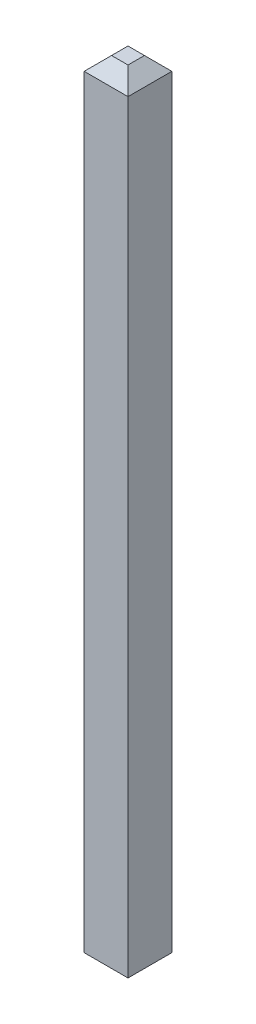
ISO-10303-21;
HEADER;
FILE_DESCRIPTION(('STEP AP214'),'2;1');
FILE_NAME('part.step','',(''),(''),'','','');
FILE_SCHEMA(('AUTOMOTIVE_DESIGN { 1 0 10303 214 1 1 1 1 }'));
ENDSEC;
DATA;
#1=APPLICATION_CONTEXT('core data for automotive mechanical design processes');
#2=APPLICATION_PROTOCOL_DEFINITION('international standard','automotive_design',2000,#1);
#3=PRODUCT_CONTEXT('',#1,'mechanical');
#4=PRODUCT('Part','Part','',(#3));
#5=PRODUCT_RELATED_PRODUCT_CATEGORY('part','',(#4));
#6=PRODUCT_DEFINITION_FORMATION('','',#4);
#7=PRODUCT_DEFINITION_CONTEXT('part definition',#1,'design');
#8=PRODUCT_DEFINITION('design','',#6,#7);
#9=PRODUCT_DEFINITION_SHAPE('','',#8);
#10=(LENGTH_UNIT() NAMED_UNIT(*) SI_UNIT(.MILLI.,.METRE.));
#11=(NAMED_UNIT(*) PLANE_ANGLE_UNIT() SI_UNIT($,.RADIAN.));
#12=(NAMED_UNIT(*) SI_UNIT($,.STERADIAN.) SOLID_ANGLE_UNIT());
#13=UNCERTAINTY_MEASURE_WITH_UNIT(LENGTH_MEASURE(1.E-05),#10,'distance_accuracy_value','');
#14=(GEOMETRIC_REPRESENTATION_CONTEXT(3) GLOBAL_UNCERTAINTY_ASSIGNED_CONTEXT((#13)) GLOBAL_UNIT_ASSIGNED_CONTEXT((#10,
#11,#12)) REPRESENTATION_CONTEXT('',''));
#15=CARTESIAN_POINT('',(0.,0.,0.));
#16=DIRECTION('',(0.,0.,1.));
#17=DIRECTION('',(1.,0.,0.));
#18=AXIS2_PLACEMENT_3D('',#15,#16,#17);
#19=CARTESIAN_POINT('',(6.67,7.07,-0.32));
#20=DIRECTION('',(-0.707106781186548,-0.707106781186548,0.));
#21=DIRECTION('',(-0.707106781186548,0.707106781186548,0.));
#22=AXIS2_PLACEMENT_3D('',#19,#20,#21);
#23=PLANE('',#22);
#24=DIRECTION('',(0.577350269189626,-0.577350269189626,0.577350269189626));
#25=VECTOR('',#24,1.);
#26=CARTESIAN_POINT('',(6.456666666667,7.283333333333,0.106666666667));
#27=LINE('',#26,#25);
#28=CARTESIAN_POINT('',(6.47,7.27,0.12));
#29=VERTEX_POINT('',#28);
#30=CARTESIAN_POINT('',(6.67,7.07,0.32));
#31=VERTEX_POINT('',#30);
#32=EDGE_CURVE('E161',#29,#31,#27,.T.);
#33=ORIENTED_EDGE('',*,*,#32,.T.);
#34=DIRECTION('',(0.,0.,1.));
#35=VECTOR('',#34,1.);
#36=CARTESIAN_POINT('',(6.67,7.07,-0.32));
#37=LINE('',#36,#35);
#38=CARTESIAN_POINT('',(6.67,7.07,-0.32));
#39=VERTEX_POINT('',#38);
#40=EDGE_CURVE('E102',#39,#31,#37,.T.);
#41=ORIENTED_EDGE('',*,*,#40,.F.);
#42=DIRECTION('',(0.577350269189626,-0.577350269189626,-0.577350269189626));
#43=VECTOR('',#42,1.);
#44=CARTESIAN_POINT('',(6.67,7.07,-0.32));
#45=LINE('',#44,#43);
#46=CARTESIAN_POINT('',(6.47,7.27,-0.12));
#47=VERTEX_POINT('',#46);
#48=EDGE_CURVE('E11',#47,#39,#45,.T.);
#49=ORIENTED_EDGE('',*,*,#48,.F.);
#50=DIRECTION('',(0.,0.,-1.));
#51=VECTOR('',#50,1.);
#52=CARTESIAN_POINT('',(6.47,7.27,-0.32));
#53=LINE('',#52,#51);
#54=EDGE_CURVE('E100',#29,#47,#53,.T.);
#55=ORIENTED_EDGE('',*,*,#54,.F.);
#56=EDGE_LOOP('',(#33,#41,#49,#55));
#57=FACE_BOUND('',#56,.T.);
#58=ADVANCED_FACE('F16',(#57),#23,.F.);
#59=CARTESIAN_POINT('',(6.35,7.07,-0.32));
#60=DIRECTION('',(0.,0.707106781186548,-0.707106781186548));
#61=DIRECTION('',(-1.,0.,0.));
#62=AXIS2_PLACEMENT_3D('',#59,#60,#61);
#63=PLANE('',#62);
#64=DIRECTION('',(0.577350269189626,0.577350269189626,0.577350269189626));
#65=VECTOR('',#64,1.);
#66=CARTESIAN_POINT('',(6.163333333333,7.203333333333,-0.186666666667));
#67=LINE('',#66,#65);
#68=CARTESIAN_POINT('',(6.03,7.07,-0.32));
#69=VERTEX_POINT('',#68);
#70=CARTESIAN_POINT('',(6.23,7.27,-0.12));
#71=VERTEX_POINT('',#70);
#72=EDGE_CURVE('E27',#69,#71,#67,.T.);
#73=ORIENTED_EDGE('',*,*,#72,.T.);
#74=DIRECTION('',(-1.,0.,0.));
#75=VECTOR('',#74,1.);
#76=CARTESIAN_POINT('',(6.03,7.27,-0.12));
#77=LINE('',#76,#75);
#78=EDGE_CURVE('E107',#47,#71,#77,.T.);
#79=ORIENTED_EDGE('',*,*,#78,.F.);
#80=ORIENTED_EDGE('',*,*,#48,.T.);
#81=DIRECTION('',(1.,0.,0.));
#82=VECTOR('',#81,1.);
#83=CARTESIAN_POINT('',(6.67,7.07,-0.32));
#84=LINE('',#83,#82);
#85=EDGE_CURVE('E157',#69,#39,#84,.T.);
#86=ORIENTED_EDGE('',*,*,#85,.F.);
#87=EDGE_LOOP('',(#73,#79,#80,#86));
#88=FACE_BOUND('',#87,.T.);
#89=ADVANCED_FACE('F108',(#88),#63,.T.);
#90=CARTESIAN_POINT('',(6.23,7.27,-0.32));
#91=DIRECTION('',(0.707106781186548,-0.707106781186548,0.));
#92=DIRECTION('',(0.,0.,-1.));
#93=AXIS2_PLACEMENT_3D('',#90,#91,#92);
#94=PLANE('',#93);
#95=DIRECTION('',(-0.577350269189626,-0.577350269189626,0.577350269189626));
#96=VECTOR('',#95,1.);
#97=CARTESIAN_POINT('',(6.163333333333,7.203333333333,0.186666666667));
#98=LINE('',#97,#96);
#99=CARTESIAN_POINT('',(6.23,7.27,0.12));
#100=VERTEX_POINT('',#99);
#101=CARTESIAN_POINT('',(6.03,7.07,0.32));
#102=VERTEX_POINT('',#101);
#103=EDGE_CURVE('E20',#100,#102,#98,.T.);
#104=ORIENTED_EDGE('',*,*,#103,.F.);
#105=DIRECTION('',(0.,0.,1.));
#106=VECTOR('',#105,1.);
#107=CARTESIAN_POINT('',(6.23,7.27,-0.32));
#108=LINE('',#107,#106);
#109=EDGE_CURVE('E112',#71,#100,#108,.T.);
#110=ORIENTED_EDGE('',*,*,#109,.F.);
#111=ORIENTED_EDGE('',*,*,#72,.F.);
#112=DIRECTION('',(0.,0.,-1.));
#113=VECTOR('',#112,1.);
#114=CARTESIAN_POINT('',(6.03,7.07,-0.32));
#115=LINE('',#114,#113);
#116=EDGE_CURVE('E148',#102,#69,#115,.T.);
#117=ORIENTED_EDGE('',*,*,#116,.F.);
#118=EDGE_LOOP('',(#104,#110,#111,#117));
#119=FACE_BOUND('',#118,.T.);
#120=ADVANCED_FACE('F226',(#119),#94,.F.);
#121=CARTESIAN_POINT('',(6.03,7.27,0.12));
#122=DIRECTION('',(0.,-0.707106781186548,-0.707106781186548));
#123=DIRECTION('',(0.,-0.707106781186548,0.707106781186548));
#124=AXIS2_PLACEMENT_3D('',#121,#122,#123);
#125=PLANE('',#124);
#126=ORIENTED_EDGE('',*,*,#32,.F.);
#127=DIRECTION('',(1.,0.,0.));
#128=VECTOR('',#127,1.);
#129=CARTESIAN_POINT('',(6.03,7.27,0.12));
#130=LINE('',#129,#128);
#131=EDGE_CURVE('E116',#100,#29,#130,.T.);
#132=ORIENTED_EDGE('',*,*,#131,.F.);
#133=ORIENTED_EDGE('',*,*,#103,.T.);
#134=DIRECTION('',(-1.,0.,0.));
#135=VECTOR('',#134,1.);
#136=CARTESIAN_POINT('',(6.35,7.07,0.32));
#137=LINE('',#136,#135);
#138=EDGE_CURVE('E123',#31,#102,#137,.T.);
#139=ORIENTED_EDGE('',*,*,#138,.F.);
#140=EDGE_LOOP('',(#126,#132,#133,#139));
#141=FACE_BOUND('',#140,.T.);
#142=ADVANCED_FACE('F231',(#141),#125,.F.);
#143=CARTESIAN_POINT('',(6.03,7.27,-0.32));
#144=DIRECTION('',(0.,-1.,0.));
#145=DIRECTION('',(0.,0.,-1.));
#146=AXIS2_PLACEMENT_3D('',#143,#144,#145);
#147=PLANE('',#146);
#148=ORIENTED_EDGE('',*,*,#54,.T.);
#149=ORIENTED_EDGE('',*,*,#78,.T.);
#150=ORIENTED_EDGE('',*,*,#109,.T.);
#151=ORIENTED_EDGE('',*,*,#131,.T.);
#152=EDGE_LOOP('',(#148,#149,#150,#151));
#153=FACE_BOUND('',#152,.T.);
#154=ADVANCED_FACE('F115',(#153),#147,.F.);
#155=CARTESIAN_POINT('',(6.67,7.27,-0.32));
#156=DIRECTION('',(-1.,0.,0.));
#157=DIRECTION('',(0.,1.,0.));
#158=AXIS2_PLACEMENT_3D('',#155,#156,#157);
#159=PLANE('',#158);
#160=DIRECTION('',(0.,-1.,0.));
#161=VECTOR('',#160,1.);
#162=CARTESIAN_POINT('',(6.67,7.27,-0.32));
#163=LINE('',#162,#161);
#164=CARTESIAN_POINT('',(6.67,-4.07,-0.32));
#165=VERTEX_POINT('',#164);
#166=EDGE_CURVE('E153',#39,#165,#163,.T.);
#167=ORIENTED_EDGE('',*,*,#166,.F.);
#168=ORIENTED_EDGE('',*,*,#40,.T.);
#169=DIRECTION('',(0.,-1.,0.));
#170=VECTOR('',#169,1.);
#171=CARTESIAN_POINT('',(6.67,7.27,0.32));
#172=LINE('',#171,#170);
#173=CARTESIAN_POINT('',(6.67,-4.07,0.32));
#174=VERTEX_POINT('',#173);
#175=EDGE_CURVE('E168',#31,#174,#172,.T.);
#176=ORIENTED_EDGE('',*,*,#175,.T.);
#177=DIRECTION('',(0.,0.,-1.));
#178=VECTOR('',#177,1.);
#179=CARTESIAN_POINT('',(6.67,-4.07,-0.32));
#180=LINE('',#179,#178);
#181=EDGE_CURVE('E133',#174,#165,#180,.T.);
#182=ORIENTED_EDGE('',*,*,#181,.T.);
#183=EDGE_LOOP('',(#167,#168,#176,#182));
#184=FACE_BOUND('',#183,.T.);
#185=ADVANCED_FACE('F252',(#184),#159,.F.);
#186=CARTESIAN_POINT('',(6.35,1.5,0.32));
#187=DIRECTION('',(0.,0.,-1.));
#188=DIRECTION('',(0.,-1.,0.));
#189=AXIS2_PLACEMENT_3D('',#186,#187,#188);
#190=PLANE('',#189);
#191=ORIENTED_EDGE('',*,*,#175,.F.);
#192=ORIENTED_EDGE('',*,*,#138,.T.);
#193=DIRECTION('',(0.,1.,0.));
#194=VECTOR('',#193,1.);
#195=CARTESIAN_POINT('',(6.03,-4.27,0.32));
#196=LINE('',#195,#194);
#197=CARTESIAN_POINT('',(6.03,-4.07,0.32));
#198=VERTEX_POINT('',#197);
#199=EDGE_CURVE('E156',#198,#102,#196,.T.);
#200=ORIENTED_EDGE('',*,*,#199,.F.);
#201=DIRECTION('',(1.,0.,0.));
#202=VECTOR('',#201,1.);
#203=CARTESIAN_POINT('',(6.35,-4.07,0.32));
#204=LINE('',#203,#202);
#205=EDGE_CURVE('E129',#198,#174,#204,.T.);
#206=ORIENTED_EDGE('',*,*,#205,.T.);
#207=EDGE_LOOP('',(#191,#192,#200,#206));
#208=FACE_BOUND('',#207,.T.);
#209=ADVANCED_FACE('F268',(#208),#190,.F.);
#210=CARTESIAN_POINT('',(6.47,-4.27,-0.32));
#211=DIRECTION('',(-0.707106781186548,0.707106781186548,0.));
#212=DIRECTION('',(0.,0.,1.));
#213=AXIS2_PLACEMENT_3D('',#210,#211,#212);
#214=PLANE('',#213);
#215=DIRECTION('',(-0.577350269189626,-0.577350269189626,0.577350269189626));
#216=VECTOR('',#215,1.);
#217=CARTESIAN_POINT('',(6.536666666667,-4.203333333333,-0.186666666667));
#218=LINE('',#217,#216);
#219=CARTESIAN_POINT('',(6.47,-4.27,-0.12));
#220=VERTEX_POINT('',#219);
#221=EDGE_CURVE('E175',#165,#220,#218,.T.);
#222=ORIENTED_EDGE('',*,*,#221,.F.);
#223=ORIENTED_EDGE('',*,*,#181,.F.);
#224=DIRECTION('',(-0.577350269189626,-0.577350269189626,-0.577350269189626));
#225=VECTOR('',#224,1.);
#226=CARTESIAN_POINT('',(6.323333333333,-4.416666666667,-0.02666666666667));
#227=LINE('',#226,#225);
#228=CARTESIAN_POINT('',(6.47,-4.27,0.12));
#229=VERTEX_POINT('',#228);
#230=EDGE_CURVE('E134',#174,#229,#227,.T.);
#231=ORIENTED_EDGE('',*,*,#230,.T.);
#232=DIRECTION('',(0.,0.,1.));
#233=VECTOR('',#232,1.);
#234=CARTESIAN_POINT('',(6.47,-4.27,-0.32));
#235=LINE('',#234,#233);
#236=EDGE_CURVE('E185',#220,#229,#235,.T.);
#237=ORIENTED_EDGE('',*,*,#236,.F.);
#238=EDGE_LOOP('',(#222,#223,#231,#237));
#239=FACE_BOUND('',#238,.T.);
#240=ADVANCED_FACE('F247',(#239),#214,.F.);
#241=CARTESIAN_POINT('',(6.67,-4.27,0.12));
#242=DIRECTION('',(0.,0.707106781186548,-0.707106781186548));
#243=DIRECTION('',(-1.,0.,0.));
#244=AXIS2_PLACEMENT_3D('',#241,#242,#243);
#245=PLANE('',#244);
#246=ORIENTED_EDGE('',*,*,#230,.F.);
#247=ORIENTED_EDGE('',*,*,#205,.F.);
#248=DIRECTION('',(-0.577350269189626,0.577350269189626,0.577350269189626));
#249=VECTOR('',#248,1.);
#250=CARTESIAN_POINT('',(6.243333333333,-4.283333333333,0.106666666667));
#251=LINE('',#250,#249);
#252=CARTESIAN_POINT('',(6.23,-4.27,0.12));
#253=VERTEX_POINT('',#252);
#254=EDGE_CURVE('E143',#253,#198,#251,.T.);
#255=ORIENTED_EDGE('',*,*,#254,.F.);
#256=DIRECTION('',(-1.,0.,0.));
#257=VECTOR('',#256,1.);
#258=CARTESIAN_POINT('',(6.67,-4.27,0.12));
#259=LINE('',#258,#257);
#260=EDGE_CURVE('E140',#229,#253,#259,.T.);
#261=ORIENTED_EDGE('',*,*,#260,.F.);
#262=EDGE_LOOP('',(#246,#247,#255,#261));
#263=FACE_BOUND('',#262,.T.);
#264=ADVANCED_FACE('F266',(#263),#245,.F.);
#265=CARTESIAN_POINT('',(6.03,-4.07,-0.32));
#266=DIRECTION('',(0.707106781186548,0.707106781186548,0.));
#267=DIRECTION('',(0.,0.,-1.));
#268=AXIS2_PLACEMENT_3D('',#265,#266,#267);
#269=PLANE('',#268);
#270=DIRECTION('',(0.577350269189626,-0.577350269189626,0.577350269189626));
#271=VECTOR('',#270,1.);
#272=CARTESIAN_POINT('',(6.136666666667,-4.176666666667,-0.213333333333));
#273=LINE('',#272,#271);
#274=CARTESIAN_POINT('',(6.03,-4.07,-0.32));
#275=VERTEX_POINT('',#274);
#276=CARTESIAN_POINT('',(6.23,-4.27,-0.12));
#277=VERTEX_POINT('',#276);
#278=EDGE_CURVE('E149',#275,#277,#273,.T.);
#279=ORIENTED_EDGE('',*,*,#278,.T.);
#280=DIRECTION('',(0.,0.,-1.));
#281=VECTOR('',#280,1.);
#282=CARTESIAN_POINT('',(6.23,-4.27,-0.32));
#283=LINE('',#282,#281);
#284=EDGE_CURVE('E135',#253,#277,#283,.T.);
#285=ORIENTED_EDGE('',*,*,#284,.F.);
#286=ORIENTED_EDGE('',*,*,#254,.T.);
#287=DIRECTION('',(0.,0.,1.));
#288=VECTOR('',#287,1.);
#289=CARTESIAN_POINT('',(6.03,-4.07,-0.32));
#290=LINE('',#289,#288);
#291=EDGE_CURVE('E144',#275,#198,#290,.T.);
#292=ORIENTED_EDGE('',*,*,#291,.F.);
#293=EDGE_LOOP('',(#279,#285,#286,#292));
#294=FACE_BOUND('',#293,.T.);
#295=ADVANCED_FACE('F18',(#294),#269,.F.);
#296=CARTESIAN_POINT('',(6.03,-4.27,-0.32));
#297=DIRECTION('',(1.,0.,0.));
#298=DIRECTION('',(0.,0.,1.));
#299=AXIS2_PLACEMENT_3D('',#296,#297,#298);
#300=PLANE('',#299);
#301=ORIENTED_EDGE('',*,*,#199,.T.);
#302=ORIENTED_EDGE('',*,*,#116,.T.);
#303=DIRECTION('',(0.,1.,0.));
#304=VECTOR('',#303,1.);
#305=CARTESIAN_POINT('',(6.03,-4.27,-0.32));
#306=LINE('',#305,#304);
#307=EDGE_CURVE('E179',#275,#69,#306,.T.);
#308=ORIENTED_EDGE('',*,*,#307,.F.);
#309=ORIENTED_EDGE('',*,*,#291,.T.);
#310=EDGE_LOOP('',(#301,#302,#308,#309));
#311=FACE_BOUND('',#310,.T.);
#312=ADVANCED_FACE('F224',(#311),#300,.F.);
#313=CARTESIAN_POINT('',(6.35,1.5,-0.32));
#314=DIRECTION('',(0.,0.,-1.));
#315=DIRECTION('',(0.,-1.,0.));
#316=AXIS2_PLACEMENT_3D('',#313,#314,#315);
#317=PLANE('',#316);
#318=ORIENTED_EDGE('',*,*,#307,.T.);
#319=ORIENTED_EDGE('',*,*,#85,.T.);
#320=ORIENTED_EDGE('',*,*,#166,.T.);
#321=DIRECTION('',(-1.,0.,0.));
#322=VECTOR('',#321,1.);
#323=CARTESIAN_POINT('',(6.03,-4.07,-0.32));
#324=LINE('',#323,#322);
#325=EDGE_CURVE('E152',#165,#275,#324,.T.);
#326=ORIENTED_EDGE('',*,*,#325,.T.);
#327=EDGE_LOOP('',(#318,#319,#320,#326));
#328=FACE_BOUND('',#327,.T.);
#329=ADVANCED_FACE('F221',(#328),#317,.T.);
#330=CARTESIAN_POINT('',(6.35,-4.07,-0.32));
#331=DIRECTION('',(0.,-0.707106781186548,-0.707106781186548));
#332=DIRECTION('',(0.,-0.707106781186548,0.707106781186548));
#333=AXIS2_PLACEMENT_3D('',#330,#331,#332);
#334=PLANE('',#333);
#335=ORIENTED_EDGE('',*,*,#278,.F.);
#336=ORIENTED_EDGE('',*,*,#325,.F.);
#337=ORIENTED_EDGE('',*,*,#221,.T.);
#338=DIRECTION('',(1.,0.,0.));
#339=VECTOR('',#338,1.);
#340=CARTESIAN_POINT('',(6.67,-4.27,-0.12));
#341=LINE('',#340,#339);
#342=EDGE_CURVE('E139',#277,#220,#341,.T.);
#343=ORIENTED_EDGE('',*,*,#342,.F.);
#344=EDGE_LOOP('',(#335,#336,#337,#343));
#345=FACE_BOUND('',#344,.T.);
#346=ADVANCED_FACE('F253',(#345),#334,.T.);
#347=CARTESIAN_POINT('',(6.67,-4.27,-0.32));
#348=DIRECTION('',(0.,1.,0.));
#349=DIRECTION('',(0.,0.,-1.));
#350=AXIS2_PLACEMENT_3D('',#347,#348,#349);
#351=PLANE('',#350);
#352=ORIENTED_EDGE('',*,*,#236,.T.);
#353=ORIENTED_EDGE('',*,*,#260,.T.);
#354=ORIENTED_EDGE('',*,*,#284,.T.);
#355=ORIENTED_EDGE('',*,*,#342,.T.);
#356=EDGE_LOOP('',(#352,#353,#354,#355));
#357=FACE_BOUND('',#356,.T.);
#358=ADVANCED_FACE('F255',(#357),#351,.F.);
#359=CLOSED_SHELL('',(#58,#89,#120,#142,#154,#185,#209,#240,#264,#295,#312,#329,#346,#358));
#360=MANIFOLD_SOLID_BREP('B1',#359);
#361=ADVANCED_BREP_SHAPE_REPRESENTATION('',(#18,#360),#14);
#362=SHAPE_DEFINITION_REPRESENTATION(#9,#361);
ENDSEC;
END-ISO-10303-21;
